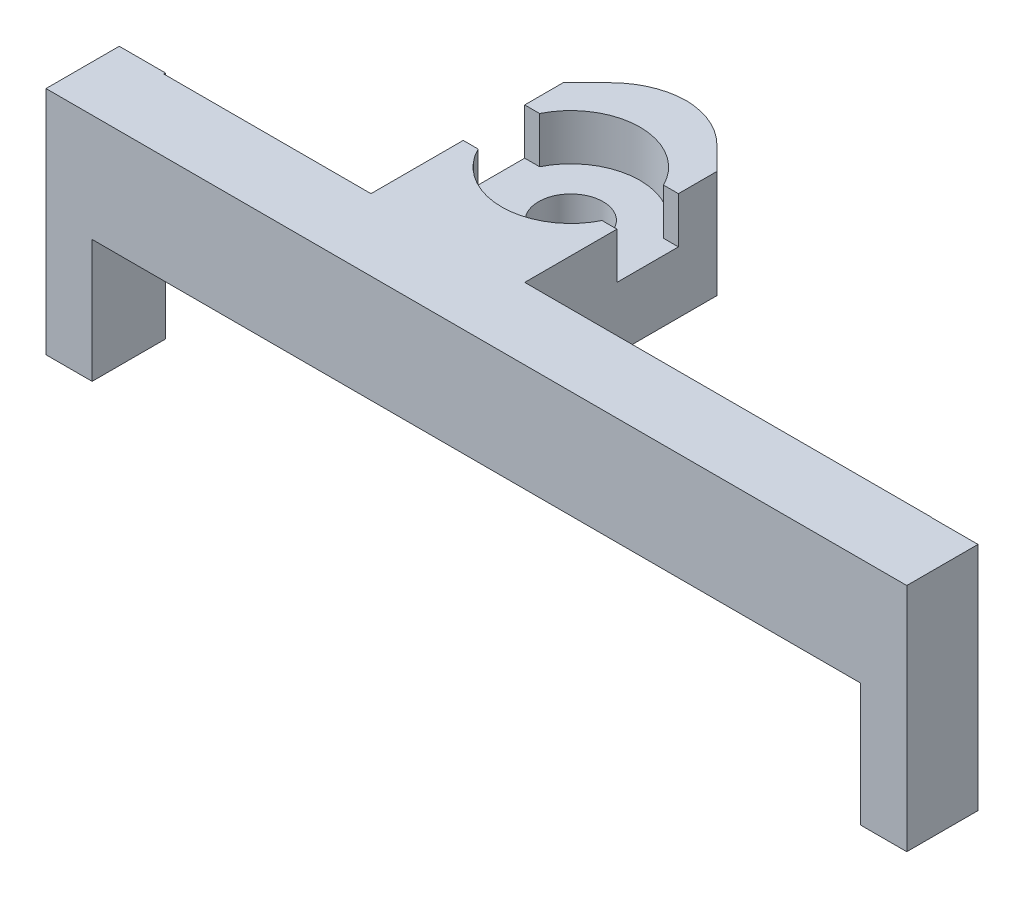
ISO-10303-21;
HEADER;
FILE_DESCRIPTION(('STEP AP214'),'2;1');
FILE_NAME('part.step','',(''),(''),'','','');
FILE_SCHEMA(('AUTOMOTIVE_DESIGN { 1 0 10303 214 1 1 1 1 }'));
ENDSEC;
DATA;
#1=APPLICATION_CONTEXT('core data for automotive mechanical design processes');
#2=APPLICATION_PROTOCOL_DEFINITION('international standard','automotive_design',2000,#1);
#3=PRODUCT_CONTEXT('',#1,'mechanical');
#4=PRODUCT('Part','Part','',(#3));
#5=PRODUCT_RELATED_PRODUCT_CATEGORY('part','',(#4));
#6=PRODUCT_DEFINITION_FORMATION('','',#4);
#7=PRODUCT_DEFINITION_CONTEXT('part definition',#1,'design');
#8=PRODUCT_DEFINITION('design','',#6,#7);
#9=PRODUCT_DEFINITION_SHAPE('','',#8);
#10=(LENGTH_UNIT() NAMED_UNIT(*) SI_UNIT(.MILLI.,.METRE.));
#11=(NAMED_UNIT(*) PLANE_ANGLE_UNIT() SI_UNIT($,.RADIAN.));
#12=(NAMED_UNIT(*) SI_UNIT($,.STERADIAN.) SOLID_ANGLE_UNIT());
#13=UNCERTAINTY_MEASURE_WITH_UNIT(LENGTH_MEASURE(1.E-05),#10,'distance_accuracy_value','');
#14=(GEOMETRIC_REPRESENTATION_CONTEXT(3) GLOBAL_UNCERTAINTY_ASSIGNED_CONTEXT((#13)) GLOBAL_UNIT_ASSIGNED_CONTEXT((#10,
#11,#12)) REPRESENTATION_CONTEXT('',''));
#15=CARTESIAN_POINT('',(0.,0.,0.));
#16=DIRECTION('',(0.,0.,1.));
#17=DIRECTION('',(1.,0.,0.));
#18=AXIS2_PLACEMENT_3D('',#15,#16,#17);
#19=CARTESIAN_POINT('',(0.,7.,0.));
#20=DIRECTION('',(0.,1.,0.));
#21=DIRECTION('',(0.,0.,1.));
#22=AXIS2_PLACEMENT_3D('',#19,#20,#21);
#23=PLANE('',#22);
#24=DIRECTION('',(0.707106781186547,0.,0.707106781186548));
#25=VECTOR('',#24,1.);
#26=CARTESIAN_POINT('',(21.9437551780046,7.,-21.9437551780046));
#27=LINE('',#26,#25);
#28=CARTESIAN_POINT('',(-18.491384598473,7.,-62.3788949544823));
#29=VERTEX_POINT('',#28);
#30=CARTESIAN_POINT('',(-20.0269185044058,7.,-63.9144288604151));
#31=VERTEX_POINT('',#30);
#32=EDGE_CURVE('E359',#29,#31,#27,.F.);
#33=ORIENTED_EDGE('',*,*,#32,.T.);
#34=CARTESIAN_POINT('',(-23.5624524103385,7.,-60.3788949544823));
#35=DIRECTION('',(0.,1.,0.));
#36=DIRECTION('',(0.,0.,1.));
#37=AXIS2_PLACEMENT_3D('',#34,#35,#36);
#38=CIRCLE('',#37,5.);
#39=CARTESIAN_POINT('',(-23.491384598473,7.,-65.3783898655825));
#40=VERTEX_POINT('',#39);
#41=EDGE_CURVE('E47',#31,#40,#38,.T.);
#42=ORIENTED_EDGE('',*,*,#41,.T.);
#43=CARTESIAN_POINT('',(-23.4203167866076,7.,-60.3788949544823));
#44=DIRECTION('',(0.,1.,0.));
#45=DIRECTION('',(0.,0.,1.));
#46=AXIS2_PLACEMENT_3D('',#43,#44,#45);
#47=CIRCLE('',#46,5.);
#48=CARTESIAN_POINT('',(-26.9558506925403,7.,-63.9144288604151));
#49=VERTEX_POINT('',#48);
#50=EDGE_CURVE('E57',#40,#49,#47,.T.);
#51=ORIENTED_EDGE('',*,*,#50,.T.);
#52=DIRECTION('',(0.70710678118655,0.,-0.707106781186545));
#53=VECTOR('',#52,1.);
#54=CARTESIAN_POINT('',(-45.4351397764776,7.,-45.4351397764779));
#55=LINE('',#54,#53);
#56=CARTESIAN_POINT('',(-28.4913845984731,7.,-62.3788949544823));
#57=VERTEX_POINT('',#56);
#58=EDGE_CURVE('E357',#49,#57,#55,.F.);
#59=ORIENTED_EDGE('',*,*,#58,.T.);
#60=DIRECTION('',(0.,0.,1.));
#61=VECTOR('',#60,1.);
#62=CARTESIAN_POINT('',(-28.4913845984731,7.,0.));
#63=LINE('',#62,#61);
#64=CARTESIAN_POINT('',(-28.4913845984731,7.,-59.8788949544824));
#65=VERTEX_POINT('',#64);
#66=EDGE_CURVE('E334',#57,#65,#63,.T.);
#67=ORIENTED_EDGE('',*,*,#66,.T.);
#68=DIRECTION('',(-1.,0.,0.));
#69=VECTOR('',#68,1.);
#70=CARTESIAN_POINT('',(-28.4913845984731,7.,-59.8788949544824));
#71=LINE('',#70,#69);
#72=CARTESIAN_POINT('',(-27.5224286281526,7.,-59.8788949544824));
#73=VERTEX_POINT('',#72);
#74=EDGE_CURVE('E227',#73,#65,#71,.T.);
#75=ORIENTED_EDGE('',*,*,#74,.F.);
#76=CARTESIAN_POINT('',(-23.4912997540033,7.,-57.8788949544824));
#77=DIRECTION('',(0.,1.,0.));
#78=DIRECTION('',(0.,0.,1.));
#79=AXIS2_PLACEMENT_3D('',#76,#77,#78);
#80=CIRCLE('',#79,4.5);
#81=CARTESIAN_POINT('',(-19.460170879854,7.,-59.8788949544824));
#82=VERTEX_POINT('',#81);
#83=EDGE_CURVE('E413',#82,#73,#80,.T.);
#84=ORIENTED_EDGE('',*,*,#83,.F.);
#85=DIRECTION('',(-1.,0.,0.));
#86=VECTOR('',#85,1.);
#87=CARTESIAN_POINT('',(-19.460170879854,7.,-59.8788949544824));
#88=LINE('',#87,#86);
#89=CARTESIAN_POINT('',(-18.491384598473,7.,-59.8788949544824));
#90=VERTEX_POINT('',#89);
#91=EDGE_CURVE('E387',#90,#82,#88,.T.);
#92=ORIENTED_EDGE('',*,*,#91,.F.);
#93=DIRECTION('',(0.,0.,-1.));
#94=VECTOR('',#93,1.);
#95=CARTESIAN_POINT('',(-18.491384598473,7.,0.));
#96=LINE('',#95,#94);
#97=EDGE_CURVE('E330',#90,#29,#96,.T.);
#98=ORIENTED_EDGE('',*,*,#97,.T.);
#99=EDGE_LOOP('',(#33,#42,#51,#59,#67,#75,#84,#92,#98));
#100=FACE_BOUND('',#99,.T.);
#101=ADVANCED_FACE('F38',(#100),#23,.T.);
#102=CARTESIAN_POINT('',(-23.4912997540033,-8.,-57.8788949544824));
#103=DIRECTION('',(0.,1.,0.));
#104=DIRECTION('',(0.,0.,1.));
#105=AXIS2_PLACEMENT_3D('',#102,#103,#104);
#106=CYLINDRICAL_SURFACE('',#105,2.1);
#107=CARTESIAN_POINT('',(-23.4912997540033,0.,-57.8788949544824));
#108=DIRECTION('',(0.,1.,0.));
#109=DIRECTION('',(0.,0.,1.));
#110=AXIS2_PLACEMENT_3D('',#107,#108,#109);
#111=CIRCLE('',#110,2.1);
#112=CARTESIAN_POINT('',(-23.4912997540033,0.,-55.7788949544824));
#113=VERTEX_POINT('',#112);
#114=EDGE_CURVE('E240',#113,#113,#111,.T.);
#115=ORIENTED_EDGE('',*,*,#114,.F.);
#116=EDGE_LOOP('',(#115));
#117=FACE_BOUND('',#116,.T.);
#118=CARTESIAN_POINT('',(-23.4912997540033,4.,-57.8788949544824));
#119=DIRECTION('',(0.,1.,0.));
#120=DIRECTION('',(0.,0.,1.));
#121=AXIS2_PLACEMENT_3D('',#118,#119,#120);
#122=CIRCLE('',#121,2.1);
#123=CARTESIAN_POINT('',(-23.4912997540033,4.,-55.7788949544824));
#124=VERTEX_POINT('',#123);
#125=EDGE_CURVE('E244',#124,#124,#122,.F.);
#126=ORIENTED_EDGE('',*,*,#125,.F.);
#127=EDGE_LOOP('',(#126));
#128=FACE_BOUND('',#127,.T.);
#129=ADVANCED_FACE('F494',(#117,#128),#106,.F.);
#130=CARTESIAN_POINT('',(8.01538499609471,7.,17.1211050455176));
#131=DIRECTION('',(-1.,0.,0.));
#132=DIRECTION('',(0.,0.,1.));
#133=AXIS2_PLACEMENT_3D('',#130,#131,#132);
#134=PLANE('',#133);
#135=DIRECTION('',(0.,1.,0.));
#136=VECTOR('',#135,1.);
#137=CARTESIAN_POINT('',(8.01538499609471,-8.,-49.8623892867953));
#138=LINE('',#137,#136);
#139=CARTESIAN_POINT('',(8.01538499609471,0.,-49.8623892867953));
#140=VERTEX_POINT('',#139);
#141=CARTESIAN_POINT('',(8.01538499609471,7.,-49.8623892867953));
#142=VERTEX_POINT('',#141);
#143=EDGE_CURVE('E293',#140,#142,#138,.T.);
#144=ORIENTED_EDGE('',*,*,#143,.F.);
#145=DIRECTION('',(0.,0.,-1.));
#146=VECTOR('',#145,1.);
#147=CARTESIAN_POINT('',(8.01538499609471,0.,17.1211050455176));
#148=LINE('',#147,#146);
#149=CARTESIAN_POINT('',(8.01538499609471,0.,-49.8788949544823));
#150=VERTEX_POINT('',#149);
#151=EDGE_CURVE('E340',#140,#150,#148,.T.);
#152=ORIENTED_EDGE('',*,*,#151,.T.);
#153=DIRECTION('',(0.,-1.,0.));
#154=VECTOR('',#153,1.);
#155=CARTESIAN_POINT('',(8.01538499609471,10.,-49.8788949544823));
#156=LINE('',#155,#154);
#157=CARTESIAN_POINT('',(8.01538499609471,7.,-49.8788949544823));
#158=VERTEX_POINT('',#157);
#159=EDGE_CURVE('E323',#158,#150,#156,.T.);
#160=ORIENTED_EDGE('',*,*,#159,.F.);
#161=DIRECTION('',(0.,0.,-1.));
#162=VECTOR('',#161,1.);
#163=CARTESIAN_POINT('',(8.01538499609471,7.,17.1211050455176));
#164=LINE('',#163,#162);
#165=EDGE_CURVE('E341',#142,#158,#164,.T.);
#166=ORIENTED_EDGE('',*,*,#165,.F.);
#167=EDGE_LOOP('',(#144,#152,#160,#166));
#168=FACE_BOUND('',#167,.T.);
#169=ADVANCED_FACE('F442',(#168),#134,.F.);
#170=CARTESIAN_POINT('',(0.,10.,-49.8788949544823));
#171=DIRECTION('',(0.,0.,-1.));
#172=DIRECTION('',(-1.,0.,0.));
#173=AXIS2_PLACEMENT_3D('',#170,#171,#172);
#174=PLANE('',#173);
#175=ORIENTED_EDGE('',*,*,#159,.T.);
#176=DIRECTION('',(1.,0.,0.));
#177=VECTOR('',#176,1.);
#178=CARTESIAN_POINT('',(0.,0.,-49.8788949544823));
#179=LINE('',#178,#177);
#180=CARTESIAN_POINT('',(-18.491384598473,0.,-49.8788949544823));
#181=VERTEX_POINT('',#180);
#182=EDGE_CURVE('E308',#181,#150,#179,.T.);
#183=ORIENTED_EDGE('',*,*,#182,.F.);
#184=DIRECTION('',(0.,-1.,0.));
#185=VECTOR('',#184,1.);
#186=CARTESIAN_POINT('',(-18.491384598473,10.,-49.8788949544823));
#187=LINE('',#186,#185);
#188=CARTESIAN_POINT('',(-18.491384598473,7.,-49.8788949544823));
#189=VERTEX_POINT('',#188);
#190=EDGE_CURVE('E320',#189,#181,#187,.T.);
#191=ORIENTED_EDGE('',*,*,#190,.F.);
#192=DIRECTION('',(-1.,0.,0.));
#193=VECTOR('',#192,1.);
#194=CARTESIAN_POINT('',(0.,7.,-49.8788949544823));
#195=LINE('',#194,#193);
#196=EDGE_CURVE('E319',#158,#189,#195,.T.);
#197=ORIENTED_EDGE('',*,*,#196,.F.);
#198=EDGE_LOOP('',(#175,#183,#191,#197));
#199=FACE_BOUND('',#198,.T.);
#200=ADVANCED_FACE('F439',(#199),#174,.T.);
#201=CARTESIAN_POINT('',(-18.491384598473,10.,0.));
#202=DIRECTION('',(1.,0.,0.));
#203=DIRECTION('',(0.,0.,-1.));
#204=AXIS2_PLACEMENT_3D('',#201,#202,#203);
#205=PLANE('',#204);
#206=DIRECTION('',(0.,1.,0.));
#207=VECTOR('',#206,1.);
#208=CARTESIAN_POINT('',(-18.491384598473,4.,-59.8788949544824));
#209=LINE('',#208,#207);
#210=CARTESIAN_POINT('',(-18.491384598473,4.,-59.8788949544824));
#211=VERTEX_POINT('',#210);
#212=EDGE_CURVE('E422',#211,#90,#209,.T.);
#213=ORIENTED_EDGE('',*,*,#212,.F.);
#214=DIRECTION('',(0.,0.,-1.));
#215=VECTOR('',#214,1.);
#216=CARTESIAN_POINT('',(-18.491384598473,4.,-55.8788949544824));
#217=LINE('',#216,#215);
#218=CARTESIAN_POINT('',(-18.491384598473,4.,-55.8788949544824));
#219=VERTEX_POINT('',#218);
#220=EDGE_CURVE('E547',#219,#211,#217,.T.);
#221=ORIENTED_EDGE('',*,*,#220,.F.);
#222=DIRECTION('',(0.,1.,0.));
#223=VECTOR('',#222,1.);
#224=CARTESIAN_POINT('',(-18.491384598473,4.,-55.8788949544824));
#225=LINE('',#224,#223);
#226=CARTESIAN_POINT('',(-18.491384598473,7.,-55.8788949544824));
#227=VERTEX_POINT('',#226);
#228=EDGE_CURVE('E424',#219,#227,#225,.T.);
#229=ORIENTED_EDGE('',*,*,#228,.T.);
#230=EDGE_CURVE('E331',#189,#227,#96,.T.);
#231=ORIENTED_EDGE('',*,*,#230,.F.);
#232=ORIENTED_EDGE('',*,*,#190,.T.);
#233=DIRECTION('',(0.,0.,1.));
#234=VECTOR('',#233,1.);
#235=CARTESIAN_POINT('',(-18.491384598473,0.,0.));
#236=LINE('',#235,#234);
#237=CARTESIAN_POINT('',(-18.491384598473,0.,-62.3788949544823));
#238=VERTEX_POINT('',#237);
#239=EDGE_CURVE('E311',#238,#181,#236,.T.);
#240=ORIENTED_EDGE('',*,*,#239,.F.);
#241=DIRECTION('',(0.,1.,0.));
#242=VECTOR('',#241,1.);
#243=CARTESIAN_POINT('',(-18.491384598473,10.,-62.3788949544823));
#244=LINE('',#243,#242);
#245=EDGE_CURVE('E354',#238,#29,#244,.T.);
#246=ORIENTED_EDGE('',*,*,#245,.T.);
#247=ORIENTED_EDGE('',*,*,#97,.F.);
#248=EDGE_LOOP('',(#213,#221,#229,#231,#232,#240,#246,#247));
#249=FACE_BOUND('',#248,.T.);
#250=ADVANCED_FACE('F391',(#249),#205,.T.);
#251=CARTESIAN_POINT('',(-28.4913845984731,10.,0.));
#252=DIRECTION('',(-1.,0.,0.));
#253=DIRECTION('',(0.,0.,1.));
#254=AXIS2_PLACEMENT_3D('',#251,#252,#253);
#255=PLANE('',#254);
#256=DIRECTION('',(0.,1.,0.));
#257=VECTOR('',#256,1.);
#258=CARTESIAN_POINT('',(-28.4913845984731,4.,-59.8788949544824));
#259=LINE('',#258,#257);
#260=CARTESIAN_POINT('',(-28.4913845984731,4.,-59.8788949544824));
#261=VERTEX_POINT('',#260);
#262=EDGE_CURVE('E367',#261,#65,#259,.T.);
#263=ORIENTED_EDGE('',*,*,#262,.T.);
#264=ORIENTED_EDGE('',*,*,#66,.F.);
#265=DIRECTION('',(0.,-1.,0.));
#266=VECTOR('',#265,1.);
#267=CARTESIAN_POINT('',(-28.4913845984731,10.,-62.3788949544823));
#268=LINE('',#267,#266);
#269=CARTESIAN_POINT('',(-28.4913845984731,0.,-62.3788949544823));
#270=VERTEX_POINT('',#269);
#271=EDGE_CURVE('E361',#57,#270,#268,.T.);
#272=ORIENTED_EDGE('',*,*,#271,.T.);
#273=DIRECTION('',(0.,0.,-1.));
#274=VECTOR('',#273,1.);
#275=CARTESIAN_POINT('',(-28.4913845984731,0.,0.));
#276=LINE('',#275,#274);
#277=CARTESIAN_POINT('',(-28.4913845984731,0.,-49.8788949544823));
#278=VERTEX_POINT('',#277);
#279=EDGE_CURVE('E313',#278,#270,#276,.T.);
#280=ORIENTED_EDGE('',*,*,#279,.F.);
#281=DIRECTION('',(0.,-1.,0.));
#282=VECTOR('',#281,1.);
#283=CARTESIAN_POINT('',(-28.4913845984731,10.,-49.8788949544823));
#284=LINE('',#283,#282);
#285=CARTESIAN_POINT('',(-28.4913845984731,7.,-49.8788949544823));
#286=VERTEX_POINT('',#285);
#287=EDGE_CURVE('E317',#286,#278,#284,.T.);
#288=ORIENTED_EDGE('',*,*,#287,.F.);
#289=CARTESIAN_POINT('',(-28.4913845984731,7.,-55.8788949544824));
#290=VERTEX_POINT('',#289);
#291=EDGE_CURVE('E232',#290,#286,#63,.T.);
#292=ORIENTED_EDGE('',*,*,#291,.F.);
#293=DIRECTION('',(0.,1.,0.));
#294=VECTOR('',#293,1.);
#295=CARTESIAN_POINT('',(-28.4913845984731,4.,-55.8788949544824));
#296=LINE('',#295,#294);
#297=CARTESIAN_POINT('',(-28.4913845984731,4.,-55.8788949544824));
#298=VERTEX_POINT('',#297);
#299=EDGE_CURVE('E209',#298,#290,#296,.T.);
#300=ORIENTED_EDGE('',*,*,#299,.F.);
#301=DIRECTION('',(0.,0.,1.));
#302=VECTOR('',#301,1.);
#303=CARTESIAN_POINT('',(-28.4913845984731,4.,-59.8788949544824));
#304=LINE('',#303,#302);
#305=EDGE_CURVE('E216',#261,#298,#304,.T.);
#306=ORIENTED_EDGE('',*,*,#305,.F.);
#307=EDGE_LOOP('',(#263,#264,#272,#280,#288,#292,#300,#306));
#308=FACE_BOUND('',#307,.T.);
#309=ADVANCED_FACE('F230',(#308),#255,.T.);
#310=CARTESIAN_POINT('',(0.,10.,-49.8788949544823));
#311=DIRECTION('',(0.,0.,-1.));
#312=DIRECTION('',(-1.,0.,0.));
#313=AXIS2_PLACEMENT_3D('',#310,#311,#312);
#314=PLANE('',#313);
#315=ORIENTED_EDGE('',*,*,#287,.T.);
#316=DIRECTION('',(1.,0.,0.));
#317=VECTOR('',#316,1.);
#318=CARTESIAN_POINT('',(0.,0.,-49.8788949544823));
#319=LINE('',#318,#317);
#320=CARTESIAN_POINT('',(-41.9846150039053,0.,-49.8788949544823));
#321=VERTEX_POINT('',#320);
#322=EDGE_CURVE('E305',#321,#278,#319,.T.);
#323=ORIENTED_EDGE('',*,*,#322,.F.);
#324=DIRECTION('',(0.,-1.,0.));
#325=VECTOR('',#324,1.);
#326=CARTESIAN_POINT('',(-41.9846150039053,10.,-49.8788949544823));
#327=LINE('',#326,#325);
#328=CARTESIAN_POINT('',(-41.9846150039053,7.,-49.8788949544823));
#329=VERTEX_POINT('',#328);
#330=EDGE_CURVE('E316',#329,#321,#327,.T.);
#331=ORIENTED_EDGE('',*,*,#330,.F.);
#332=DIRECTION('',(-1.,0.,0.));
#333=VECTOR('',#332,1.);
#334=CARTESIAN_POINT('',(0.,7.,-49.8788949544823));
#335=LINE('',#334,#333);
#336=EDGE_CURVE('E337',#286,#329,#335,.T.);
#337=ORIENTED_EDGE('',*,*,#336,.F.);
#338=EDGE_LOOP('',(#315,#323,#331,#337));
#339=FACE_BOUND('',#338,.T.);
#340=ADVANCED_FACE('F468',(#339),#314,.T.);
#341=CARTESIAN_POINT('',(0.,0.,0.));
#342=DIRECTION('',(0.,1.,0.));
#343=DIRECTION('',(0.,0.,1.));
#344=AXIS2_PLACEMENT_3D('',#341,#342,#343);
#345=PLANE('',#344);
#346=ORIENTED_EDGE('',*,*,#114,.T.);
#347=EDGE_LOOP('',(#346));
#348=FACE_BOUND('',#347,.T.);
#349=CARTESIAN_POINT('',(-23.4203167866076,0.,-60.3788949544823));
#350=DIRECTION('',(0.,1.,0.));
#351=DIRECTION('',(0.,0.,1.));
#352=AXIS2_PLACEMENT_3D('',#349,#350,#351);
#353=CIRCLE('',#352,5.);
#354=CARTESIAN_POINT('',(-26.9558506925403,0.,-63.9144288604151));
#355=VERTEX_POINT('',#354);
#356=CARTESIAN_POINT('',(-23.491384598473,0.,-65.3783898655825));
#357=VERTEX_POINT('',#356);
#358=EDGE_CURVE('E364',#355,#357,#353,.F.);
#359=ORIENTED_EDGE('',*,*,#358,.T.);
#360=CARTESIAN_POINT('',(-23.5624524103385,0.,-60.3788949544823));
#361=DIRECTION('',(0.,1.,0.));
#362=DIRECTION('',(0.,0.,1.));
#363=AXIS2_PLACEMENT_3D('',#360,#361,#362);
#364=CIRCLE('',#363,5.);
#365=CARTESIAN_POINT('',(-20.0269185044058,0.,-63.9144288604151));
#366=VERTEX_POINT('',#365);
#367=EDGE_CURVE('E369',#357,#366,#364,.F.);
#368=ORIENTED_EDGE('',*,*,#367,.T.);
#369=DIRECTION('',(-0.707106781186547,0.,-0.707106781186548));
#370=VECTOR('',#369,1.);
#371=CARTESIAN_POINT('',(-21.4913845984731,0.,-65.3788949544823));
#372=LINE('',#371,#370);
#373=EDGE_CURVE('E352',#366,#238,#372,.F.);
#374=ORIENTED_EDGE('',*,*,#373,.T.);
#375=ORIENTED_EDGE('',*,*,#239,.T.);
#376=ORIENTED_EDGE('',*,*,#182,.T.);
#377=ORIENTED_EDGE('',*,*,#151,.F.);
#378=CARTESIAN_POINT('',(8.01538499609471,0.,-45.2288949544823));
#379=VERTEX_POINT('',#378);
#380=EDGE_CURVE('E344',#379,#140,#148,.T.);
#381=ORIENTED_EDGE('',*,*,#380,.F.);
#382=DIRECTION('',(-1.,0.,0.));
#383=VECTOR('',#382,1.);
#384=CARTESIAN_POINT('',(0.,0.,-45.2288949544823));
#385=LINE('',#384,#383);
#386=CARTESIAN_POINT('',(-41.9846150039053,0.,-45.2288949544823));
#387=VERTEX_POINT('',#386);
#388=EDGE_CURVE('E301',#379,#387,#385,.T.);
#389=ORIENTED_EDGE('',*,*,#388,.T.);
#390=DIRECTION('',(0.,0.,1.));
#391=VECTOR('',#390,1.);
#392=CARTESIAN_POINT('',(-41.9846150039053,0.,17.1211050455176));
#393=LINE('',#392,#391);
#394=EDGE_CURVE('E343',#321,#387,#393,.T.);
#395=ORIENTED_EDGE('',*,*,#394,.F.);
#396=ORIENTED_EDGE('',*,*,#322,.T.);
#397=ORIENTED_EDGE('',*,*,#279,.T.);
#398=DIRECTION('',(-0.70710678118655,0.,0.707106781186545));
#399=VECTOR('',#398,1.);
#400=CARTESIAN_POINT('',(-28.4913845984731,0.,-62.3788949544823));
#401=LINE('',#400,#399);
#402=EDGE_CURVE('E349',#270,#355,#401,.F.);
#403=ORIENTED_EDGE('',*,*,#402,.T.);
#404=EDGE_LOOP('',(#359,#368,#374,#375,#376,#377,#381,#389,#395,#396,#397,#403));
#405=FACE_BOUND('',#404,.T.);
#406=ADVANCED_FACE('F395',(#348,#405),#345,.F.);
#407=DIRECTION('',(1.,0.,0.));
#408=VECTOR('',#407,1.);
#409=CARTESIAN_POINT('',(-19.460170879854,7.,-55.8788949544824));
#410=LINE('',#409,#408);
#411=CARTESIAN_POINT('',(-19.460170879854,7.,-55.8788949544824));
#412=VERTEX_POINT('',#411);
#413=EDGE_CURVE('E407',#412,#227,#410,.T.);
#414=ORIENTED_EDGE('',*,*,#413,.F.);
#415=CARTESIAN_POINT('',(-23.4912997540033,7.,-57.8788949544824));
#416=DIRECTION('',(0.,1.,0.));
#417=DIRECTION('',(0.,0.,1.));
#418=AXIS2_PLACEMENT_3D('',#415,#416,#417);
#419=CIRCLE('',#418,4.5);
#420=CARTESIAN_POINT('',(-27.5224286281526,7.,-55.8788949544824));
#421=VERTEX_POINT('',#420);
#422=EDGE_CURVE('E403',#421,#412,#419,.T.);
#423=ORIENTED_EDGE('',*,*,#422,.F.);
#424=DIRECTION('',(1.,0.,0.));
#425=VECTOR('',#424,1.);
#426=CARTESIAN_POINT('',(-28.4913845984731,7.,-55.8788949544824));
#427=LINE('',#426,#425);
#428=EDGE_CURVE('E402',#290,#421,#427,.T.);
#429=ORIENTED_EDGE('',*,*,#428,.F.);
#430=ORIENTED_EDGE('',*,*,#291,.T.);
#431=ORIENTED_EDGE('',*,*,#336,.T.);
#432=DIRECTION('',(0.,0.,-1.));
#433=VECTOR('',#432,1.);
#434=CARTESIAN_POINT('',(-41.9846150039053,7.,-45.2288949544823));
#435=LINE('',#434,#433);
#436=CARTESIAN_POINT('',(-41.9846150039053,7.,-49.9941119316356));
#437=VERTEX_POINT('',#436);
#438=EDGE_CURVE('E256',#329,#437,#435,.T.);
#439=ORIENTED_EDGE('',*,*,#438,.T.);
#440=DIRECTION('',(-1.,0.,0.));
#441=VECTOR('',#440,1.);
#442=CARTESIAN_POINT('',(-41.9846150039053,7.,-49.9941119316356));
#443=LINE('',#442,#441);
#444=CARTESIAN_POINT('',(-44.9846150039053,7.,-49.9941119316356));
#445=VERTEX_POINT('',#444);
#446=EDGE_CURVE('E262',#437,#445,#443,.T.);
#447=ORIENTED_EDGE('',*,*,#446,.T.);
#448=DIRECTION('',(0.,0.,-1.));
#449=VECTOR('',#448,1.);
#450=CARTESIAN_POINT('',(-44.9846150039053,7.,-45.2288949544823));
#451=LINE('',#450,#449);
#452=CARTESIAN_POINT('',(-44.9846150039053,7.,-45.2288949544823));
#453=VERTEX_POINT('',#452);
#454=EDGE_CURVE('E258',#453,#445,#451,.T.);
#455=ORIENTED_EDGE('',*,*,#454,.F.);
#456=DIRECTION('',(1.,0.,0.));
#457=VECTOR('',#456,1.);
#458=CARTESIAN_POINT('',(0.,7.,-45.2288949544823));
#459=LINE('',#458,#457);
#460=CARTESIAN_POINT('',(11.0153849960947,7.,-45.2288949544823));
#461=VERTEX_POINT('',#460);
#462=EDGE_CURVE('E303',#453,#461,#459,.T.);
#463=ORIENTED_EDGE('',*,*,#462,.T.);
#464=DIRECTION('',(0.,0.,-1.));
#465=VECTOR('',#464,1.);
#466=CARTESIAN_POINT('',(11.0153849960947,7.,-45.2288949544823));
#467=LINE('',#466,#465);
#468=CARTESIAN_POINT('',(11.0153849960947,7.,-49.8623892867953));
#469=VERTEX_POINT('',#468);
#470=EDGE_CURVE('E277',#461,#469,#467,.T.);
#471=ORIENTED_EDGE('',*,*,#470,.T.);
#472=DIRECTION('',(1.,0.,0.));
#473=VECTOR('',#472,1.);
#474=CARTESIAN_POINT('',(8.01538499609471,7.,-49.8623892867953));
#475=LINE('',#474,#473);
#476=EDGE_CURVE('E265',#142,#469,#475,.T.);
#477=ORIENTED_EDGE('',*,*,#476,.F.);
#478=ORIENTED_EDGE('',*,*,#165,.T.);
#479=ORIENTED_EDGE('',*,*,#196,.T.);
#480=ORIENTED_EDGE('',*,*,#230,.T.);
#481=EDGE_LOOP('',(#414,#423,#429,#430,#431,#439,#447,#455,#463,#471,#477,#478,#479,#480));
#482=FACE_BOUND('',#481,.T.);
#483=ADVANCED_FACE('F435',(#482),#23,.T.);
#484=CARTESIAN_POINT('',(0.,28.,-45.2288949544823));
#485=DIRECTION('',(0.,0.,1.));
#486=DIRECTION('',(1.,0.,0.));
#487=AXIS2_PLACEMENT_3D('',#484,#485,#486);
#488=PLANE('',#487);
#489=ORIENTED_EDGE('',*,*,#462,.F.);
#490=DIRECTION('',(0.,1.,0.));
#491=VECTOR('',#490,1.);
#492=CARTESIAN_POINT('',(-44.9846150039053,-8.,-45.2288949544823));
#493=LINE('',#492,#491);
#494=CARTESIAN_POINT('',(-44.9846150039053,-8.,-45.2288949544823));
#495=VERTEX_POINT('',#494);
#496=EDGE_CURVE('E248',#495,#453,#493,.T.);
#497=ORIENTED_EDGE('',*,*,#496,.F.);
#498=DIRECTION('',(-1.,0.,0.));
#499=VECTOR('',#498,1.);
#500=CARTESIAN_POINT('',(-41.9846150039053,-8.,-45.2288949544823));
#501=LINE('',#500,#499);
#502=CARTESIAN_POINT('',(-41.9846150039053,-8.,-45.2288949544823));
#503=VERTEX_POINT('',#502);
#504=EDGE_CURVE('E268',#503,#495,#501,.T.);
#505=ORIENTED_EDGE('',*,*,#504,.F.);
#506=DIRECTION('',(0.,1.,0.));
#507=VECTOR('',#506,1.);
#508=CARTESIAN_POINT('',(-41.9846150039053,-8.,-45.2288949544823));
#509=LINE('',#508,#507);
#510=EDGE_CURVE('E251',#503,#387,#509,.T.);
#511=ORIENTED_EDGE('',*,*,#510,.T.);
#512=ORIENTED_EDGE('',*,*,#388,.F.);
#513=DIRECTION('',(0.,1.,0.));
#514=VECTOR('',#513,1.);
#515=CARTESIAN_POINT('',(8.01538499609471,-8.,-45.2288949544823));
#516=LINE('',#515,#514);
#517=CARTESIAN_POINT('',(8.01538499609471,-8.,-45.2288949544823));
#518=VERTEX_POINT('',#517);
#519=EDGE_CURVE('E292',#518,#379,#516,.T.);
#520=ORIENTED_EDGE('',*,*,#519,.F.);
#521=DIRECTION('',(1.,0.,0.));
#522=VECTOR('',#521,1.);
#523=CARTESIAN_POINT('',(8.01538499609471,-8.,-45.2288949544823));
#524=LINE('',#523,#522);
#525=CARTESIAN_POINT('',(11.0153849960947,-8.,-45.2288949544823));
#526=VERTEX_POINT('',#525);
#527=EDGE_CURVE('E280',#518,#526,#524,.T.);
#528=ORIENTED_EDGE('',*,*,#527,.T.);
#529=DIRECTION('',(0.,1.,0.));
#530=VECTOR('',#529,1.);
#531=CARTESIAN_POINT('',(11.0153849960947,-8.,-45.2288949544823));
#532=LINE('',#531,#530);
#533=EDGE_CURVE('E296',#526,#461,#532,.T.);
#534=ORIENTED_EDGE('',*,*,#533,.T.);
#535=EDGE_LOOP('',(#489,#497,#505,#511,#512,#520,#528,#534));
#536=FACE_BOUND('',#535,.T.);
#537=ADVANCED_FACE('F459',(#536),#488,.T.);
#538=CARTESIAN_POINT('',(8.01538499609471,-8.,-45.2288949544823));
#539=DIRECTION('',(1.,0.,0.));
#540=DIRECTION('',(0.,0.,-1.));
#541=AXIS2_PLACEMENT_3D('',#538,#539,#540);
#542=PLANE('',#541);
#543=ORIENTED_EDGE('',*,*,#519,.T.);
#544=ORIENTED_EDGE('',*,*,#380,.T.);
#545=CARTESIAN_POINT('',(8.01538499609471,-8.,-49.8623892867953));
#546=VERTEX_POINT('',#545);
#547=EDGE_CURVE('E285',#546,#140,#138,.T.);
#548=ORIENTED_EDGE('',*,*,#547,.F.);
#549=DIRECTION('',(0.,0.,-1.));
#550=VECTOR('',#549,1.);
#551=CARTESIAN_POINT('',(8.01538499609471,-8.,-45.2288949544823));
#552=LINE('',#551,#550);
#553=EDGE_CURVE('E283',#518,#546,#552,.T.);
#554=ORIENTED_EDGE('',*,*,#553,.F.);
#555=EDGE_LOOP('',(#543,#544,#548,#554));
#556=FACE_BOUND('',#555,.T.);
#557=ADVANCED_FACE('F447',(#556),#542,.F.);
#558=CARTESIAN_POINT('',(8.01538499609471,-8.,-49.8623892867953));
#559=DIRECTION('',(0.,0.,1.));
#560=DIRECTION('',(1.,0.,0.));
#561=AXIS2_PLACEMENT_3D('',#558,#559,#560);
#562=PLANE('',#561);
#563=ORIENTED_EDGE('',*,*,#476,.T.);
#564=DIRECTION('',(0.,1.,0.));
#565=VECTOR('',#564,1.);
#566=CARTESIAN_POINT('',(11.0153849960947,-8.,-49.8623892867953));
#567=LINE('',#566,#565);
#568=CARTESIAN_POINT('',(11.0153849960947,-8.,-49.8623892867953));
#569=VERTEX_POINT('',#568);
#570=EDGE_CURVE('E299',#569,#469,#567,.T.);
#571=ORIENTED_EDGE('',*,*,#570,.F.);
#572=DIRECTION('',(1.,0.,0.));
#573=VECTOR('',#572,1.);
#574=CARTESIAN_POINT('',(8.01538499609471,-8.,-49.8623892867953));
#575=LINE('',#574,#573);
#576=EDGE_CURVE('E274',#546,#569,#575,.T.);
#577=ORIENTED_EDGE('',*,*,#576,.F.);
#578=ORIENTED_EDGE('',*,*,#547,.T.);
#579=ORIENTED_EDGE('',*,*,#143,.T.);
#580=EDGE_LOOP('',(#563,#571,#577,#578,#579));
#581=FACE_BOUND('',#580,.T.);
#582=ADVANCED_FACE('F451',(#581),#562,.F.);
#583=CARTESIAN_POINT('',(11.0153849960947,-8.,-45.2288949544823));
#584=DIRECTION('',(1.,0.,0.));
#585=DIRECTION('',(0.,0.,-1.));
#586=AXIS2_PLACEMENT_3D('',#583,#584,#585);
#587=PLANE('',#586);
#588=ORIENTED_EDGE('',*,*,#470,.F.);
#589=ORIENTED_EDGE('',*,*,#533,.F.);
#590=DIRECTION('',(0.,0.,-1.));
#591=VECTOR('',#590,1.);
#592=CARTESIAN_POINT('',(11.0153849960947,-8.,-45.2288949544823));
#593=LINE('',#592,#591);
#594=EDGE_CURVE('E276',#526,#569,#593,.T.);
#595=ORIENTED_EDGE('',*,*,#594,.T.);
#596=ORIENTED_EDGE('',*,*,#570,.T.);
#597=EDGE_LOOP('',(#588,#589,#595,#596));
#598=FACE_BOUND('',#597,.T.);
#599=ADVANCED_FACE('F738',(#598),#587,.T.);
#600=CARTESIAN_POINT('',(0.,-8.,0.));
#601=DIRECTION('',(0.,1.,0.));
#602=DIRECTION('',(0.,0.,1.));
#603=AXIS2_PLACEMENT_3D('',#600,#601,#602);
#604=PLANE('',#603);
#605=ORIENTED_EDGE('',*,*,#576,.T.);
#606=ORIENTED_EDGE('',*,*,#594,.F.);
#607=ORIENTED_EDGE('',*,*,#527,.F.);
#608=ORIENTED_EDGE('',*,*,#553,.T.);
#609=EDGE_LOOP('',(#605,#606,#607,#608));
#610=FACE_BOUND('',#609,.T.);
#611=ADVANCED_FACE('F456',(#610),#604,.F.);
#612=CARTESIAN_POINT('',(-41.9846150039053,-8.,-49.9941119316356));
#613=DIRECTION('',(0.,0.,-1.));
#614=DIRECTION('',(-1.,0.,0.));
#615=AXIS2_PLACEMENT_3D('',#612,#613,#614);
#616=PLANE('',#615);
#617=ORIENTED_EDGE('',*,*,#446,.F.);
#618=DIRECTION('',(0.,1.,0.));
#619=VECTOR('',#618,1.);
#620=CARTESIAN_POINT('',(-41.9846150039053,-8.,-49.9941119316356));
#621=LINE('',#620,#619);
#622=CARTESIAN_POINT('',(-41.9846150039053,-8.,-49.9941119316356));
#623=VERTEX_POINT('',#622);
#624=EDGE_CURVE('E243',#623,#437,#621,.T.);
#625=ORIENTED_EDGE('',*,*,#624,.F.);
#626=DIRECTION('',(-1.,0.,0.));
#627=VECTOR('',#626,1.);
#628=CARTESIAN_POINT('',(-41.9846150039053,-8.,-49.9941119316356));
#629=LINE('',#628,#627);
#630=CARTESIAN_POINT('',(-44.9846150039053,-8.,-49.9941119316356));
#631=VERTEX_POINT('',#630);
#632=EDGE_CURVE('E259',#623,#631,#629,.T.);
#633=ORIENTED_EDGE('',*,*,#632,.T.);
#634=DIRECTION('',(0.,1.,0.));
#635=VECTOR('',#634,1.);
#636=CARTESIAN_POINT('',(-44.9846150039053,-8.,-49.9941119316356));
#637=LINE('',#636,#635);
#638=EDGE_CURVE('E245',#631,#445,#637,.T.);
#639=ORIENTED_EDGE('',*,*,#638,.T.);
#640=EDGE_LOOP('',(#617,#625,#633,#639));
#641=FACE_BOUND('',#640,.T.);
#642=ADVANCED_FACE('F474',(#641),#616,.T.);
#643=CARTESIAN_POINT('',(-41.9846150039053,-8.,-45.2288949544823));
#644=DIRECTION('',(1.,0.,0.));
#645=DIRECTION('',(0.,0.,-1.));
#646=AXIS2_PLACEMENT_3D('',#643,#644,#645);
#647=PLANE('',#646);
#648=ORIENTED_EDGE('',*,*,#438,.F.);
#649=ORIENTED_EDGE('',*,*,#330,.T.);
#650=ORIENTED_EDGE('',*,*,#394,.T.);
#651=ORIENTED_EDGE('',*,*,#510,.F.);
#652=DIRECTION('',(0.,0.,-1.));
#653=VECTOR('',#652,1.);
#654=CARTESIAN_POINT('',(-41.9846150039053,-8.,-45.2288949544823));
#655=LINE('',#654,#653);
#656=EDGE_CURVE('E247',#503,#623,#655,.T.);
#657=ORIENTED_EDGE('',*,*,#656,.T.);
#658=ORIENTED_EDGE('',*,*,#624,.T.);
#659=EDGE_LOOP('',(#648,#649,#650,#651,#657,#658));
#660=FACE_BOUND('',#659,.T.);
#661=ADVANCED_FACE('F465',(#660),#647,.T.);
#662=CARTESIAN_POINT('',(-44.9846150039053,-8.,-45.2288949544823));
#663=DIRECTION('',(1.,0.,0.));
#664=DIRECTION('',(0.,0.,-1.));
#665=AXIS2_PLACEMENT_3D('',#662,#663,#664);
#666=PLANE('',#665);
#667=ORIENTED_EDGE('',*,*,#454,.T.);
#668=ORIENTED_EDGE('',*,*,#638,.F.);
#669=DIRECTION('',(0.,0.,-1.));
#670=VECTOR('',#669,1.);
#671=CARTESIAN_POINT('',(-44.9846150039053,-8.,-45.2288949544823));
#672=LINE('',#671,#670);
#673=EDGE_CURVE('E270',#495,#631,#672,.T.);
#674=ORIENTED_EDGE('',*,*,#673,.F.);
#675=ORIENTED_EDGE('',*,*,#496,.T.);
#676=EDGE_LOOP('',(#667,#668,#674,#675));
#677=FACE_BOUND('',#676,.T.);
#678=ADVANCED_FACE('F478',(#677),#666,.F.);
#679=CARTESIAN_POINT('',(0.,-8.,0.));
#680=DIRECTION('',(0.,-1.,0.));
#681=DIRECTION('',(0.,0.,-1.));
#682=AXIS2_PLACEMENT_3D('',#679,#680,#681);
#683=PLANE('',#682);
#684=ORIENTED_EDGE('',*,*,#632,.F.);
#685=ORIENTED_EDGE('',*,*,#656,.F.);
#686=ORIENTED_EDGE('',*,*,#504,.T.);
#687=ORIENTED_EDGE('',*,*,#673,.T.);
#688=EDGE_LOOP('',(#684,#685,#686,#687));
#689=FACE_BOUND('',#688,.T.);
#690=ADVANCED_FACE('F481',(#689),#683,.T.);
#691=CARTESIAN_POINT('',(-21.4913845984731,10.,-65.3788949544823));
#692=DIRECTION('',(-0.707106781186548,0.,0.707106781186547));
#693=DIRECTION('',(0.,-1.,0.));
#694=AXIS2_PLACEMENT_3D('',#691,#692,#693);
#695=PLANE('',#694);
#696=ORIENTED_EDGE('',*,*,#373,.F.);
#697=DIRECTION('',(0.,-1.,0.));
#698=VECTOR('',#697,1.);
#699=CARTESIAN_POINT('',(-20.0269185044058,10.,-63.9144288604151));
#700=LINE('',#699,#698);
#701=EDGE_CURVE('E371',#366,#31,#700,.F.);
#702=ORIENTED_EDGE('',*,*,#701,.T.);
#703=ORIENTED_EDGE('',*,*,#32,.F.);
#704=ORIENTED_EDGE('',*,*,#245,.F.);
#705=EDGE_LOOP('',(#696,#702,#703,#704));
#706=FACE_BOUND('',#705,.T.);
#707=ADVANCED_FACE('F379',(#706),#695,.F.);
#708=CARTESIAN_POINT('',(-28.4913845984731,10.,-62.3788949544823));
#709=DIRECTION('',(0.707106781186545,0.,0.70710678118655));
#710=DIRECTION('',(0.,-1.,0.));
#711=AXIS2_PLACEMENT_3D('',#708,#709,#710);
#712=PLANE('',#711);
#713=ORIENTED_EDGE('',*,*,#58,.F.);
#714=DIRECTION('',(0.,1.,0.));
#715=VECTOR('',#714,1.);
#716=CARTESIAN_POINT('',(-26.9558506925403,10.,-63.9144288604151));
#717=LINE('',#716,#715);
#718=EDGE_CURVE('E11',#49,#355,#717,.F.);
#719=ORIENTED_EDGE('',*,*,#718,.T.);
#720=ORIENTED_EDGE('',*,*,#402,.F.);
#721=ORIENTED_EDGE('',*,*,#271,.F.);
#722=EDGE_LOOP('',(#713,#719,#720,#721));
#723=FACE_BOUND('',#722,.T.);
#724=ADVANCED_FACE('F488',(#723),#712,.F.);
#725=CARTESIAN_POINT('',(-23.4912997540033,4.,-57.8788949544824));
#726=DIRECTION('',(0.,1.,0.));
#727=DIRECTION('',(0.,0.,1.));
#728=AXIS2_PLACEMENT_3D('',#725,#726,#727);
#729=PLANE('',#728);
#730=ORIENTED_EDGE('',*,*,#305,.T.);
#731=DIRECTION('',(1.,0.,0.));
#732=VECTOR('',#731,1.);
#733=CARTESIAN_POINT('',(-28.4913845984731,4.,-55.8788949544824));
#734=LINE('',#733,#732);
#735=CARTESIAN_POINT('',(-27.5224286281526,4.,-55.8788949544824));
#736=VERTEX_POINT('',#735);
#737=EDGE_CURVE('E204',#298,#736,#734,.T.);
#738=ORIENTED_EDGE('',*,*,#737,.T.);
#739=CARTESIAN_POINT('',(-23.4912997540033,4.,-57.8788949544824));
#740=DIRECTION('',(0.,1.,0.));
#741=DIRECTION('',(0.,0.,1.));
#742=AXIS2_PLACEMENT_3D('',#739,#740,#741);
#743=CIRCLE('',#742,4.5);
#744=CARTESIAN_POINT('',(-19.460170879854,4.,-55.8788949544824));
#745=VERTEX_POINT('',#744);
#746=EDGE_CURVE('E215',#736,#745,#743,.T.);
#747=ORIENTED_EDGE('',*,*,#746,.T.);
#748=DIRECTION('',(1.,0.,0.));
#749=VECTOR('',#748,1.);
#750=CARTESIAN_POINT('',(-19.460170879854,4.,-55.8788949544824));
#751=LINE('',#750,#749);
#752=EDGE_CURVE('E431',#745,#219,#751,.T.);
#753=ORIENTED_EDGE('',*,*,#752,.T.);
#754=ORIENTED_EDGE('',*,*,#220,.T.);
#755=DIRECTION('',(-1.,0.,0.));
#756=VECTOR('',#755,1.);
#757=CARTESIAN_POINT('',(-19.460170879854,4.,-59.8788949544824));
#758=LINE('',#757,#756);
#759=CARTESIAN_POINT('',(-19.460170879854,4.,-59.8788949544824));
#760=VERTEX_POINT('',#759);
#761=EDGE_CURVE('E545',#211,#760,#758,.T.);
#762=ORIENTED_EDGE('',*,*,#761,.T.);
#763=CARTESIAN_POINT('',(-23.4912997540033,4.,-57.8788949544824));
#764=DIRECTION('',(0.,1.,0.));
#765=DIRECTION('',(0.,0.,1.));
#766=AXIS2_PLACEMENT_3D('',#763,#764,#765);
#767=CIRCLE('',#766,4.5);
#768=CARTESIAN_POINT('',(-27.5224286281526,4.,-59.8788949544824));
#769=VERTEX_POINT('',#768);
#770=EDGE_CURVE('E236',#760,#769,#767,.T.);
#771=ORIENTED_EDGE('',*,*,#770,.T.);
#772=DIRECTION('',(-1.,0.,0.));
#773=VECTOR('',#772,1.);
#774=CARTESIAN_POINT('',(-28.4913845984731,4.,-59.8788949544824));
#775=LINE('',#774,#773);
#776=EDGE_CURVE('E224',#769,#261,#775,.T.);
#777=ORIENTED_EDGE('',*,*,#776,.T.);
#778=EDGE_LOOP('',(#730,#738,#747,#753,#754,#762,#771,#777));
#779=FACE_BOUND('',#778,.T.);
#780=ORIENTED_EDGE('',*,*,#125,.T.);
#781=EDGE_LOOP('',(#780));
#782=FACE_BOUND('',#781,.T.);
#783=ADVANCED_FACE('F220',(#779,#782),#729,.T.);
#784=CARTESIAN_POINT('',(-28.4913845984731,4.,-59.8788949544824));
#785=DIRECTION('',(0.,0.,-1.));
#786=DIRECTION('',(-1.,0.,0.));
#787=AXIS2_PLACEMENT_3D('',#784,#785,#786);
#788=PLANE('',#787);
#789=ORIENTED_EDGE('',*,*,#74,.T.);
#790=ORIENTED_EDGE('',*,*,#262,.F.);
#791=ORIENTED_EDGE('',*,*,#776,.F.);
#792=DIRECTION('',(0.,1.,0.));
#793=VECTOR('',#792,1.);
#794=CARTESIAN_POINT('',(-27.5224286281526,4.,-59.8788949544824));
#795=LINE('',#794,#793);
#796=EDGE_CURVE('E418',#769,#73,#795,.T.);
#797=ORIENTED_EDGE('',*,*,#796,.T.);
#798=EDGE_LOOP('',(#789,#790,#791,#797));
#799=FACE_BOUND('',#798,.T.);
#800=ADVANCED_FACE('F538',(#799),#788,.F.);
#801=CARTESIAN_POINT('',(-23.4912997540033,4.,-57.8788949544824));
#802=DIRECTION('',(0.,1.,0.));
#803=DIRECTION('',(0.,0.,1.));
#804=AXIS2_PLACEMENT_3D('',#801,#802,#803);
#805=CYLINDRICAL_SURFACE('',#804,4.5);
#806=ORIENTED_EDGE('',*,*,#83,.T.);
#807=ORIENTED_EDGE('',*,*,#796,.F.);
#808=ORIENTED_EDGE('',*,*,#770,.F.);
#809=DIRECTION('',(0.,1.,0.));
#810=VECTOR('',#809,1.);
#811=CARTESIAN_POINT('',(-19.460170879854,4.,-59.8788949544824));
#812=LINE('',#811,#810);
#813=EDGE_CURVE('E420',#760,#82,#812,.T.);
#814=ORIENTED_EDGE('',*,*,#813,.T.);
#815=EDGE_LOOP('',(#806,#807,#808,#814));
#816=FACE_BOUND('',#815,.T.);
#817=ADVANCED_FACE('F541',(#816),#805,.F.);
#818=CARTESIAN_POINT('',(-19.460170879854,4.,-59.8788949544824));
#819=DIRECTION('',(0.,0.,-1.));
#820=DIRECTION('',(-1.,0.,0.));
#821=AXIS2_PLACEMENT_3D('',#818,#819,#820);
#822=PLANE('',#821);
#823=ORIENTED_EDGE('',*,*,#91,.T.);
#824=ORIENTED_EDGE('',*,*,#813,.F.);
#825=ORIENTED_EDGE('',*,*,#761,.F.);
#826=ORIENTED_EDGE('',*,*,#212,.T.);
#827=EDGE_LOOP('',(#823,#824,#825,#826));
#828=FACE_BOUND('',#827,.T.);
#829=ADVANCED_FACE('F544',(#828),#822,.F.);
#830=CARTESIAN_POINT('',(-19.460170879854,4.,-55.8788949544824));
#831=DIRECTION('',(0.,0.,1.));
#832=DIRECTION('',(1.,0.,0.));
#833=AXIS2_PLACEMENT_3D('',#830,#831,#832);
#834=PLANE('',#833);
#835=ORIENTED_EDGE('',*,*,#413,.T.);
#836=ORIENTED_EDGE('',*,*,#228,.F.);
#837=ORIENTED_EDGE('',*,*,#752,.F.);
#838=DIRECTION('',(0.,1.,0.));
#839=VECTOR('',#838,1.);
#840=CARTESIAN_POINT('',(-19.460170879854,4.,-55.8788949544824));
#841=LINE('',#840,#839);
#842=EDGE_CURVE('E234',#745,#412,#841,.T.);
#843=ORIENTED_EDGE('',*,*,#842,.T.);
#844=EDGE_LOOP('',(#835,#836,#837,#843));
#845=FACE_BOUND('',#844,.T.);
#846=ADVANCED_FACE('F428',(#845),#834,.F.);
#847=CARTESIAN_POINT('',(-23.4912997540033,4.,-57.8788949544824));
#848=DIRECTION('',(0.,1.,0.));
#849=DIRECTION('',(0.,0.,1.));
#850=AXIS2_PLACEMENT_3D('',#847,#848,#849);
#851=CYLINDRICAL_SURFACE('',#850,4.5);
#852=ORIENTED_EDGE('',*,*,#422,.T.);
#853=ORIENTED_EDGE('',*,*,#842,.F.);
#854=ORIENTED_EDGE('',*,*,#746,.F.);
#855=DIRECTION('',(0.,1.,0.));
#856=VECTOR('',#855,1.);
#857=CARTESIAN_POINT('',(-27.5224286281526,4.,-55.8788949544824));
#858=LINE('',#857,#856);
#859=EDGE_CURVE('E211',#736,#421,#858,.T.);
#860=ORIENTED_EDGE('',*,*,#859,.T.);
#861=EDGE_LOOP('',(#852,#853,#854,#860));
#862=FACE_BOUND('',#861,.T.);
#863=ADVANCED_FACE('F433',(#862),#851,.F.);
#864=CARTESIAN_POINT('',(-28.4913845984731,4.,-55.8788949544824));
#865=DIRECTION('',(0.,0.,1.));
#866=DIRECTION('',(1.,0.,0.));
#867=AXIS2_PLACEMENT_3D('',#864,#865,#866);
#868=PLANE('',#867);
#869=ORIENTED_EDGE('',*,*,#428,.T.);
#870=ORIENTED_EDGE('',*,*,#859,.F.);
#871=ORIENTED_EDGE('',*,*,#737,.F.);
#872=ORIENTED_EDGE('',*,*,#299,.T.);
#873=EDGE_LOOP('',(#869,#870,#871,#872));
#874=FACE_BOUND('',#873,.T.);
#875=ADVANCED_FACE('F207',(#874),#868,.F.);
#876=CARTESIAN_POINT('',(-23.4203167866076,10.,-60.3788949544823));
#877=DIRECTION('',(0.,-1.,0.));
#878=DIRECTION('',(0.,0.,-1.));
#879=AXIS2_PLACEMENT_3D('',#876,#877,#878);
#880=CYLINDRICAL_SURFACE('',#879,5.);
#881=ORIENTED_EDGE('',*,*,#718,.F.);
#882=ORIENTED_EDGE('',*,*,#50,.F.);
#883=DIRECTION('',(0.,-1.,0.));
#884=VECTOR('',#883,1.);
#885=CARTESIAN_POINT('',(-23.491384598473,3.5,-65.3783898655825));
#886=LINE('',#885,#884);
#887=EDGE_CURVE('E42',#357,#40,#886,.F.);
#888=ORIENTED_EDGE('',*,*,#887,.F.);
#889=ORIENTED_EDGE('',*,*,#358,.F.);
#890=EDGE_LOOP('',(#881,#882,#888,#889));
#891=FACE_BOUND('',#890,.T.);
#892=ADVANCED_FACE('F40',(#891),#880,.T.);
#893=CARTESIAN_POINT('',(-23.5624524103385,10.,-60.3788949544823));
#894=DIRECTION('',(0.,1.,0.));
#895=DIRECTION('',(0.,0.,1.));
#896=AXIS2_PLACEMENT_3D('',#893,#894,#895);
#897=CYLINDRICAL_SURFACE('',#896,5.);
#898=ORIENTED_EDGE('',*,*,#41,.F.);
#899=ORIENTED_EDGE('',*,*,#701,.F.);
#900=ORIENTED_EDGE('',*,*,#367,.F.);
#901=ORIENTED_EDGE('',*,*,#887,.T.);
#902=EDGE_LOOP('',(#898,#899,#900,#901));
#903=FACE_BOUND('',#902,.T.);
#904=ADVANCED_FACE('F400',(#903),#897,.T.);
#905=CLOSED_SHELL('',(#101,#129,#169,#200,#250,#309,#340,#406,#483,#537,#557,#582,#599,#611,
#642,#661,#678,#690,#707,#724,#783,#800,#817,#829,#846,#863,#875,#892,#904));
#906=MANIFOLD_SOLID_BREP('B2',#905);
#907=ADVANCED_BREP_SHAPE_REPRESENTATION('',(#18,#906),#14);
#908=SHAPE_DEFINITION_REPRESENTATION(#9,#907);
ENDSEC;
END-ISO-10303-21;
